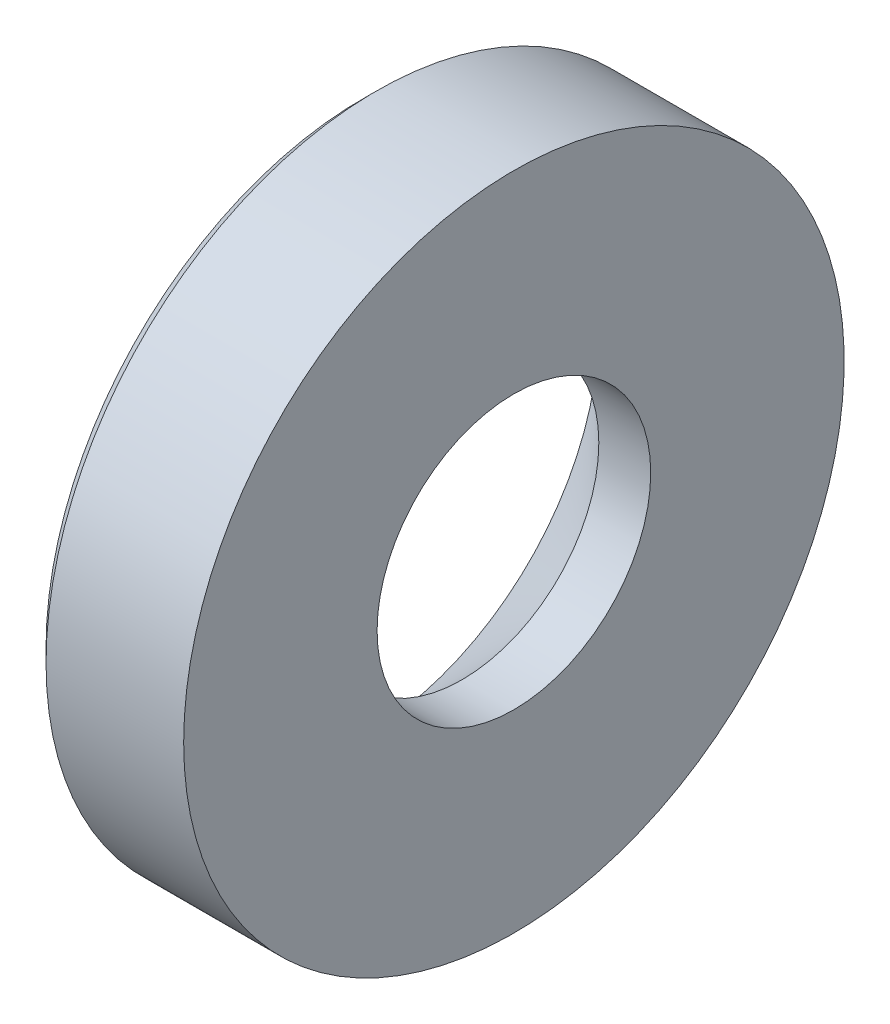
ISO-10303-21;
HEADER;
FILE_DESCRIPTION(('STEP AP214'),'2;1');
FILE_NAME('part.step','',(''),(''),'','','');
FILE_SCHEMA(('AUTOMOTIVE_DESIGN { 1 0 10303 214 1 1 1 1 }'));
ENDSEC;
DATA;
#1=APPLICATION_CONTEXT('core data for automotive mechanical design processes');
#2=APPLICATION_PROTOCOL_DEFINITION('international standard','automotive_design',2000,#1);
#3=PRODUCT_CONTEXT('',#1,'mechanical');
#4=PRODUCT('Part','Part','',(#3));
#5=PRODUCT_RELATED_PRODUCT_CATEGORY('part','',(#4));
#6=PRODUCT_DEFINITION_FORMATION('','',#4);
#7=PRODUCT_DEFINITION_CONTEXT('part definition',#1,'design');
#8=PRODUCT_DEFINITION('design','',#6,#7);
#9=PRODUCT_DEFINITION_SHAPE('','',#8);
#10=(LENGTH_UNIT() NAMED_UNIT(*) SI_UNIT(.MILLI.,.METRE.));
#11=(NAMED_UNIT(*) PLANE_ANGLE_UNIT() SI_UNIT($,.RADIAN.));
#12=(NAMED_UNIT(*) SI_UNIT($,.STERADIAN.) SOLID_ANGLE_UNIT());
#13=UNCERTAINTY_MEASURE_WITH_UNIT(LENGTH_MEASURE(1.E-05),#10,'distance_accuracy_value','');
#14=(GEOMETRIC_REPRESENTATION_CONTEXT(3) GLOBAL_UNCERTAINTY_ASSIGNED_CONTEXT((#13)) GLOBAL_UNIT_ASSIGNED_CONTEXT((#10,
#11,#12)) REPRESENTATION_CONTEXT('',''));
#15=CARTESIAN_POINT('',(0.,0.,0.));
#16=DIRECTION('',(0.,0.,1.));
#17=DIRECTION('',(1.,0.,0.));
#18=AXIS2_PLACEMENT_3D('',#15,#16,#17);
#19=CARTESIAN_POINT('',(29.2249371552177,0.,0.));
#20=DIRECTION('',(-1.,0.,0.));
#21=DIRECTION('',(0.,0.,1.));
#22=AXIS2_PLACEMENT_3D('',#19,#20,#21);
#23=CONICAL_SURFACE('',#22,12.5,0.785398163397444);
#24=CARTESIAN_POINT('',(34.4749371552177,0.,0.));
#25=DIRECTION('',(-1.,0.,0.));
#26=DIRECTION('',(0.,0.,1.));
#27=AXIS2_PLACEMENT_3D('',#24,#25,#26);
#28=CIRCLE('',#27,7.25);
#29=CARTESIAN_POINT('',(34.4749371552177,0.,7.25));
#30=VERTEX_POINT('',#29);
#31=EDGE_CURVE('E53',#30,#30,#28,.T.);
#32=ORIENTED_EDGE('',*,*,#31,.F.);
#33=EDGE_LOOP('',(#32));
#34=FACE_BOUND('',#33,.T.);
#35=CARTESIAN_POINT('',(29.2249371552177,0.,0.));
#36=DIRECTION('',(-1.,0.,0.));
#37=DIRECTION('',(0.,0.,1.));
#38=AXIS2_PLACEMENT_3D('',#35,#36,#37);
#39=CIRCLE('',#38,12.5);
#40=CARTESIAN_POINT('',(29.2249371552177,0.,12.5));
#41=VERTEX_POINT('',#40);
#42=EDGE_CURVE('E10',#41,#41,#39,.T.);
#43=ORIENTED_EDGE('',*,*,#42,.T.);
#44=EDGE_LOOP('',(#43));
#45=FACE_BOUND('',#44,.T.);
#46=ADVANCED_FACE('F31',(#34,#45),#23,.F.);
#47=CARTESIAN_POINT('',(29.2249371552177,12.5,0.));
#48=DIRECTION('',(1.,0.,0.));
#49=DIRECTION('',(0.,0.,-1.));
#50=AXIS2_PLACEMENT_3D('',#47,#48,#49);
#51=PLANE('',#50);
#52=ORIENTED_EDGE('',*,*,#42,.F.);
#53=EDGE_LOOP('',(#52));
#54=FACE_BOUND('',#53,.T.);
#55=CARTESIAN_POINT('',(29.2249371552177,0.,0.));
#56=DIRECTION('',(-1.,0.,0.));
#57=DIRECTION('',(0.,0.,1.));
#58=AXIS2_PLACEMENT_3D('',#55,#56,#57);
#59=CIRCLE('',#58,16.7928932188135);
#60=CARTESIAN_POINT('',(29.2249371552177,0.,16.7928932188135));
#61=VERTEX_POINT('',#60);
#62=EDGE_CURVE('E37',#61,#61,#59,.T.);
#63=ORIENTED_EDGE('',*,*,#62,.T.);
#64=EDGE_LOOP('',(#63));
#65=FACE_BOUND('',#64,.T.);
#66=ADVANCED_FACE('F60',(#54,#65),#51,.F.);
#67=CARTESIAN_POINT('',(29.9320439364042,0.,0.));
#68=DIRECTION('',(1.,0.,0.));
#69=DIRECTION('',(0.,0.,-1.));
#70=AXIS2_PLACEMENT_3D('',#67,#68,#69);
#71=CONICAL_SURFACE('',#70,17.5,0.785398163397448);
#72=ORIENTED_EDGE('',*,*,#62,.F.);
#73=EDGE_LOOP('',(#72));
#74=FACE_BOUND('',#73,.T.);
#75=CARTESIAN_POINT('',(29.9320439364042,0.,0.));
#76=DIRECTION('',(-1.,0.,0.));
#77=DIRECTION('',(0.,0.,1.));
#78=AXIS2_PLACEMENT_3D('',#75,#76,#77);
#79=CIRCLE('',#78,17.5);
#80=CARTESIAN_POINT('',(29.9320439364042,0.,17.5));
#81=VERTEX_POINT('',#80);
#82=EDGE_CURVE('E41',#81,#81,#79,.T.);
#83=ORIENTED_EDGE('',*,*,#82,.T.);
#84=EDGE_LOOP('',(#83));
#85=FACE_BOUND('',#84,.T.);
#86=ADVANCED_FACE('F64',(#74,#85),#71,.T.);
#87=CARTESIAN_POINT('',(-58.7539083798659,0.,0.));
#88=DIRECTION('',(-1.,0.,0.));
#89=DIRECTION('',(0.,0.,1.));
#90=AXIS2_PLACEMENT_3D('',#87,#88,#89);
#91=CYLINDRICAL_SURFACE('',#90,17.5);
#92=ORIENTED_EDGE('',*,*,#82,.F.);
#93=EDGE_LOOP('',(#92));
#94=FACE_BOUND('',#93,.T.);
#95=CARTESIAN_POINT('',(37.2249371552177,0.,0.));
#96=DIRECTION('',(-1.,0.,0.));
#97=DIRECTION('',(0.,0.,1.));
#98=AXIS2_PLACEMENT_3D('',#95,#96,#97);
#99=CIRCLE('',#98,17.5);
#100=CARTESIAN_POINT('',(37.2249371552177,0.,17.5));
#101=VERTEX_POINT('',#100);
#102=EDGE_CURVE('E45',#101,#101,#99,.T.);
#103=ORIENTED_EDGE('',*,*,#102,.T.);
#104=EDGE_LOOP('',(#103));
#105=FACE_BOUND('',#104,.T.);
#106=ADVANCED_FACE('F69',(#94,#105),#91,.T.);
#107=CARTESIAN_POINT('',(37.2249371552177,7.25,0.));
#108=DIRECTION('',(-1.,0.,0.));
#109=DIRECTION('',(0.,0.,1.));
#110=AXIS2_PLACEMENT_3D('',#107,#108,#109);
#111=PLANE('',#110);
#112=ORIENTED_EDGE('',*,*,#102,.F.);
#113=EDGE_LOOP('',(#112));
#114=FACE_BOUND('',#113,.T.);
#115=CARTESIAN_POINT('',(37.2249371552177,0.,0.));
#116=DIRECTION('',(-1.,0.,0.));
#117=DIRECTION('',(0.,0.,1.));
#118=AXIS2_PLACEMENT_3D('',#115,#116,#117);
#119=CIRCLE('',#118,7.25);
#120=CARTESIAN_POINT('',(37.2249371552177,0.,7.25));
#121=VERTEX_POINT('',#120);
#122=EDGE_CURVE('E50',#121,#121,#119,.T.);
#123=ORIENTED_EDGE('',*,*,#122,.T.);
#124=EDGE_LOOP('',(#123));
#125=FACE_BOUND('',#124,.T.);
#126=ADVANCED_FACE('F75',(#114,#125),#111,.F.);
#127=CARTESIAN_POINT('',(-58.7539083798659,0.,0.));
#128=DIRECTION('',(-1.,0.,0.));
#129=DIRECTION('',(0.,0.,1.));
#130=AXIS2_PLACEMENT_3D('',#127,#128,#129);
#131=CYLINDRICAL_SURFACE('',#130,7.25);
#132=ORIENTED_EDGE('',*,*,#122,.F.);
#133=EDGE_LOOP('',(#132));
#134=FACE_BOUND('',#133,.T.);
#135=ORIENTED_EDGE('',*,*,#31,.T.);
#136=EDGE_LOOP('',(#135));
#137=FACE_BOUND('',#136,.T.);
#138=ADVANCED_FACE('F57',(#134,#137),#131,.F.);
#139=CLOSED_SHELL('',(#46,#66,#86,#106,#126,#138));
#140=MANIFOLD_SOLID_BREP('B2',#139);
#141=ADVANCED_BREP_SHAPE_REPRESENTATION('',(#18,#140),#14);
#142=SHAPE_DEFINITION_REPRESENTATION(#9,#141);
ENDSEC;
END-ISO-10303-21;
